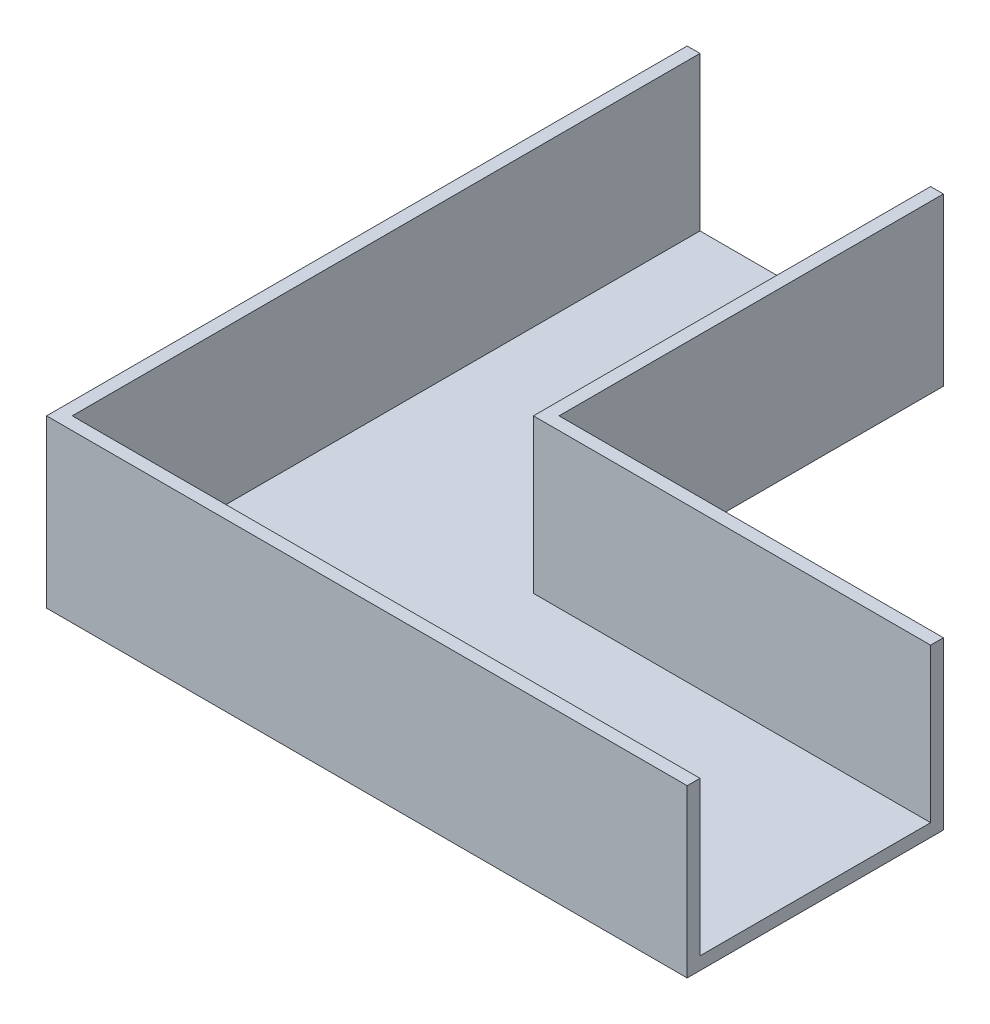
ISO-10303-21;
HEADER;
FILE_DESCRIPTION(('STEP AP214'),'2;1');
FILE_NAME('part.step','',(''),(''),'','','');
FILE_SCHEMA(('AUTOMOTIVE_DESIGN { 1 0 10303 214 1 1 1 1 }'));
ENDSEC;
DATA;
#1=APPLICATION_CONTEXT('core data for automotive mechanical design processes');
#2=APPLICATION_PROTOCOL_DEFINITION('international standard','automotive_design',2000,#1);
#3=PRODUCT_CONTEXT('',#1,'mechanical');
#4=PRODUCT('Part','Part','',(#3));
#5=PRODUCT_RELATED_PRODUCT_CATEGORY('part','',(#4));
#6=PRODUCT_DEFINITION_FORMATION('','',#4);
#7=PRODUCT_DEFINITION_CONTEXT('part definition',#1,'design');
#8=PRODUCT_DEFINITION('design','',#6,#7);
#9=PRODUCT_DEFINITION_SHAPE('','',#8);
#10=(LENGTH_UNIT() NAMED_UNIT(*) SI_UNIT(.MILLI.,.METRE.));
#11=(NAMED_UNIT(*) PLANE_ANGLE_UNIT() SI_UNIT($,.RADIAN.));
#12=(NAMED_UNIT(*) SI_UNIT($,.STERADIAN.) SOLID_ANGLE_UNIT());
#13=UNCERTAINTY_MEASURE_WITH_UNIT(LENGTH_MEASURE(1.E-05),#10,'distance_accuracy_value','');
#14=(GEOMETRIC_REPRESENTATION_CONTEXT(3) GLOBAL_UNCERTAINTY_ASSIGNED_CONTEXT((#13)) GLOBAL_UNIT_ASSIGNED_CONTEXT((#10,
#11,#12)) REPRESENTATION_CONTEXT('',''));
#15=CARTESIAN_POINT('',(0.,0.,0.));
#16=DIRECTION('',(0.,0.,1.));
#17=DIRECTION('',(1.,0.,0.));
#18=AXIS2_PLACEMENT_3D('',#15,#16,#17);
#19=CARTESIAN_POINT('',(0.,330.2,0.));
#20=DIRECTION('',(0.,1.,0.));
#21=DIRECTION('',(0.,0.,1.));
#22=AXIS2_PLACEMENT_3D('',#19,#20,#21);
#23=PLANE('',#22);
#24=DIRECTION('',(0.,0.,-1.));
#25=VECTOR('',#24,1.);
#26=CARTESIAN_POINT('',(482.6,330.2,-482.6));
#27=LINE('',#26,#25);
#28=CARTESIAN_POINT('',(482.6,330.2,-482.6));
#29=VERTEX_POINT('',#28);
#30=CARTESIAN_POINT('',(482.6,330.2,-1270.));
#31=VERTEX_POINT('',#30);
#32=EDGE_CURVE('E169',#29,#31,#27,.T.);
#33=ORIENTED_EDGE('',*,*,#32,.F.);
#34=DIRECTION('',(-1.,0.,0.));
#35=VECTOR('',#34,1.);
#36=CARTESIAN_POINT('',(1270.,330.2,-482.6));
#37=LINE('',#36,#35);
#38=CARTESIAN_POINT('',(1270.,330.2,-482.6));
#39=VERTEX_POINT('',#38);
#40=EDGE_CURVE('E233',#39,#29,#37,.T.);
#41=ORIENTED_EDGE('',*,*,#40,.F.);
#42=DIRECTION('',(0.,0.,-1.));
#43=VECTOR('',#42,1.);
#44=CARTESIAN_POINT('',(1270.,330.2,0.));
#45=LINE('',#44,#43);
#46=CARTESIAN_POINT('',(1270.,330.2,-508.));
#47=VERTEX_POINT('',#46);
#48=EDGE_CURVE('E114',#39,#47,#45,.T.);
#49=ORIENTED_EDGE('',*,*,#48,.T.);
#50=DIRECTION('',(-1.,0.,0.));
#51=VECTOR('',#50,1.);
#52=CARTESIAN_POINT('',(1270.,330.2,-508.));
#53=LINE('',#52,#51);
#54=CARTESIAN_POINT('',(508.,330.2,-508.));
#55=VERTEX_POINT('',#54);
#56=EDGE_CURVE('E105',#47,#55,#53,.T.);
#57=ORIENTED_EDGE('',*,*,#56,.T.);
#58=DIRECTION('',(0.,0.,-1.));
#59=VECTOR('',#58,1.);
#60=CARTESIAN_POINT('',(508.,330.2,-508.));
#61=LINE('',#60,#59);
#62=CARTESIAN_POINT('',(508.,330.2,-1270.));
#63=VERTEX_POINT('',#62);
#64=EDGE_CURVE('E110',#55,#63,#61,.T.);
#65=ORIENTED_EDGE('',*,*,#64,.T.);
#66=DIRECTION('',(-1.,0.,0.));
#67=VECTOR('',#66,1.);
#68=CARTESIAN_POINT('',(508.,330.2,-1270.));
#69=LINE('',#68,#67);
#70=EDGE_CURVE('E133',#63,#31,#69,.T.);
#71=ORIENTED_EDGE('',*,*,#70,.T.);
#72=EDGE_LOOP('',(#33,#41,#49,#57,#65,#71));
#73=FACE_BOUND('',#72,.T.);
#74=ADVANCED_FACE('F35',(#73),#23,.T.);
#75=CARTESIAN_POINT('',(0.,330.2,-1270.));
#76=DIRECTION('',(1.,0.,0.));
#77=DIRECTION('',(0.,0.,-1.));
#78=AXIS2_PLACEMENT_3D('',#75,#76,#77);
#79=PLANE('',#78);
#80=DIRECTION('',(0.,0.,1.));
#81=VECTOR('',#80,1.);
#82=CARTESIAN_POINT('',(0.,0.,-1270.));
#83=LINE('',#82,#81);
#84=CARTESIAN_POINT('',(0.,0.,-1270.));
#85=VERTEX_POINT('',#84);
#86=CARTESIAN_POINT('',(0.,0.,0.));
#87=VERTEX_POINT('',#86);
#88=EDGE_CURVE('E138',#85,#87,#83,.T.);
#89=ORIENTED_EDGE('',*,*,#88,.T.);
#90=DIRECTION('',(0.,-1.,0.));
#91=VECTOR('',#90,1.);
#92=CARTESIAN_POINT('',(0.,330.2,0.));
#93=LINE('',#92,#91);
#94=CARTESIAN_POINT('',(0.,330.2,0.));
#95=VERTEX_POINT('',#94);
#96=EDGE_CURVE('E11',#95,#87,#93,.T.);
#97=ORIENTED_EDGE('',*,*,#96,.F.);
#98=DIRECTION('',(0.,0.,1.));
#99=VECTOR('',#98,1.);
#100=CARTESIAN_POINT('',(0.,330.2,-1270.));
#101=LINE('',#100,#99);
#102=CARTESIAN_POINT('',(0.,330.2,-1270.));
#103=VERTEX_POINT('',#102);
#104=EDGE_CURVE('E150',#103,#95,#101,.T.);
#105=ORIENTED_EDGE('',*,*,#104,.F.);
#106=DIRECTION('',(0.,-1.,0.));
#107=VECTOR('',#106,1.);
#108=CARTESIAN_POINT('',(0.,330.2,-1270.));
#109=LINE('',#108,#107);
#110=EDGE_CURVE('E137',#103,#85,#109,.T.);
#111=ORIENTED_EDGE('',*,*,#110,.T.);
#112=EDGE_LOOP('',(#89,#97,#105,#111));
#113=FACE_BOUND('',#112,.T.);
#114=ADVANCED_FACE('F37',(#113),#79,.F.);
#115=CARTESIAN_POINT('',(0.,330.2,0.));
#116=DIRECTION('',(0.,0.,-1.));
#117=DIRECTION('',(-1.,0.,0.));
#118=AXIS2_PLACEMENT_3D('',#115,#116,#117);
#119=PLANE('',#118);
#120=DIRECTION('',(1.,0.,0.));
#121=VECTOR('',#120,1.);
#122=CARTESIAN_POINT('',(0.,0.,0.));
#123=LINE('',#122,#121);
#124=CARTESIAN_POINT('',(1270.,0.,0.));
#125=VERTEX_POINT('',#124);
#126=EDGE_CURVE('E141',#87,#125,#123,.T.);
#127=ORIENTED_EDGE('',*,*,#126,.T.);
#128=DIRECTION('',(0.,-1.,0.));
#129=VECTOR('',#128,1.);
#130=CARTESIAN_POINT('',(1270.,330.2,0.));
#131=LINE('',#130,#129);
#132=CARTESIAN_POINT('',(1270.,330.2,0.));
#133=VERTEX_POINT('',#132);
#134=EDGE_CURVE('E43',#133,#125,#131,.T.);
#135=ORIENTED_EDGE('',*,*,#134,.F.);
#136=DIRECTION('',(1.,0.,0.));
#137=VECTOR('',#136,1.);
#138=CARTESIAN_POINT('',(0.,330.2,0.));
#139=LINE('',#138,#137);
#140=EDGE_CURVE('E94',#95,#133,#139,.T.);
#141=ORIENTED_EDGE('',*,*,#140,.F.);
#142=ORIENTED_EDGE('',*,*,#96,.T.);
#143=EDGE_LOOP('',(#127,#135,#141,#142));
#144=FACE_BOUND('',#143,.T.);
#145=ADVANCED_FACE('F247',(#144),#119,.F.);
#146=CARTESIAN_POINT('',(1270.,330.2,0.));
#147=DIRECTION('',(-1.,0.,0.));
#148=DIRECTION('',(0.,0.,1.));
#149=AXIS2_PLACEMENT_3D('',#146,#147,#148);
#150=PLANE('',#149);
#151=ORIENTED_EDGE('',*,*,#48,.F.);
#152=DIRECTION('',(0.,1.,0.));
#153=VECTOR('',#152,1.);
#154=CARTESIAN_POINT('',(1270.,25.4,-482.6));
#155=LINE('',#154,#153);
#156=CARTESIAN_POINT('',(1270.,25.4,-482.6));
#157=VERTEX_POINT('',#156);
#158=EDGE_CURVE('E238',#157,#39,#155,.T.);
#159=ORIENTED_EDGE('',*,*,#158,.F.);
#160=DIRECTION('',(0.,0.,-1.));
#161=VECTOR('',#160,1.);
#162=CARTESIAN_POINT('',(1270.,25.4,-25.4));
#163=LINE('',#162,#161);
#164=CARTESIAN_POINT('',(1270.,25.4,-25.4));
#165=VERTEX_POINT('',#164);
#166=EDGE_CURVE('E216',#165,#157,#163,.T.);
#167=ORIENTED_EDGE('',*,*,#166,.F.);
#168=DIRECTION('',(0.,1.,0.));
#169=VECTOR('',#168,1.);
#170=CARTESIAN_POINT('',(1270.,25.4,-25.4));
#171=LINE('',#170,#169);
#172=CARTESIAN_POINT('',(1270.,330.2,-25.4));
#173=VERTEX_POINT('',#172);
#174=EDGE_CURVE('E208',#165,#173,#171,.T.);
#175=ORIENTED_EDGE('',*,*,#174,.T.);
#176=EDGE_CURVE('E118',#133,#173,#45,.T.);
#177=ORIENTED_EDGE('',*,*,#176,.F.);
#178=ORIENTED_EDGE('',*,*,#134,.T.);
#179=DIRECTION('',(0.,0.,-1.));
#180=VECTOR('',#179,1.);
#181=CARTESIAN_POINT('',(1270.,0.,0.));
#182=LINE('',#181,#180);
#183=CARTESIAN_POINT('',(1270.,0.,-508.));
#184=VERTEX_POINT('',#183);
#185=EDGE_CURVE('E144',#125,#184,#182,.T.);
#186=ORIENTED_EDGE('',*,*,#185,.T.);
#187=DIRECTION('',(0.,-1.,0.));
#188=VECTOR('',#187,1.);
#189=CARTESIAN_POINT('',(1270.,330.2,-508.));
#190=LINE('',#189,#188);
#191=EDGE_CURVE('E127',#47,#184,#190,.T.);
#192=ORIENTED_EDGE('',*,*,#191,.F.);
#193=EDGE_LOOP('',(#151,#159,#167,#175,#177,#178,#186,#192));
#194=FACE_BOUND('',#193,.T.);
#195=ADVANCED_FACE('F157',(#194),#150,.F.);
#196=CARTESIAN_POINT('',(1270.,330.2,-508.));
#197=DIRECTION('',(0.,0.,1.));
#198=DIRECTION('',(1.,0.,0.));
#199=AXIS2_PLACEMENT_3D('',#196,#197,#198);
#200=PLANE('',#199);
#201=DIRECTION('',(-1.,0.,0.));
#202=VECTOR('',#201,1.);
#203=CARTESIAN_POINT('',(1270.,0.,-508.));
#204=LINE('',#203,#202);
#205=CARTESIAN_POINT('',(508.,0.,-508.));
#206=VERTEX_POINT('',#205);
#207=EDGE_CURVE('E124',#184,#206,#204,.T.);
#208=ORIENTED_EDGE('',*,*,#207,.T.);
#209=DIRECTION('',(0.,-1.,0.));
#210=VECTOR('',#209,1.);
#211=CARTESIAN_POINT('',(508.,330.2,-508.));
#212=LINE('',#211,#210);
#213=EDGE_CURVE('E121',#55,#206,#212,.T.);
#214=ORIENTED_EDGE('',*,*,#213,.F.);
#215=ORIENTED_EDGE('',*,*,#56,.F.);
#216=ORIENTED_EDGE('',*,*,#191,.T.);
#217=EDGE_LOOP('',(#208,#214,#215,#216));
#218=FACE_BOUND('',#217,.T.);
#219=ADVANCED_FACE('F122',(#218),#200,.F.);
#220=CARTESIAN_POINT('',(508.,330.2,-508.));
#221=DIRECTION('',(-1.,0.,0.));
#222=DIRECTION('',(0.,0.,1.));
#223=AXIS2_PLACEMENT_3D('',#220,#221,#222);
#224=PLANE('',#223);
#225=DIRECTION('',(0.,0.,-1.));
#226=VECTOR('',#225,1.);
#227=CARTESIAN_POINT('',(508.,0.,-508.));
#228=LINE('',#227,#226);
#229=CARTESIAN_POINT('',(508.,0.,-1270.));
#230=VERTEX_POINT('',#229);
#231=EDGE_CURVE('E147',#206,#230,#228,.T.);
#232=ORIENTED_EDGE('',*,*,#231,.T.);
#233=DIRECTION('',(0.,-1.,0.));
#234=VECTOR('',#233,1.);
#235=CARTESIAN_POINT('',(508.,330.2,-1270.));
#236=LINE('',#235,#234);
#237=EDGE_CURVE('E128',#63,#230,#236,.T.);
#238=ORIENTED_EDGE('',*,*,#237,.F.);
#239=ORIENTED_EDGE('',*,*,#64,.F.);
#240=ORIENTED_EDGE('',*,*,#213,.T.);
#241=EDGE_LOOP('',(#232,#238,#239,#240));
#242=FACE_BOUND('',#241,.T.);
#243=ADVANCED_FACE('F130',(#242),#224,.F.);
#244=CARTESIAN_POINT('',(508.,330.2,-1270.));
#245=DIRECTION('',(0.,0.,1.));
#246=DIRECTION('',(1.,0.,0.));
#247=AXIS2_PLACEMENT_3D('',#244,#245,#246);
#248=PLANE('',#247);
#249=DIRECTION('',(-1.,0.,0.));
#250=VECTOR('',#249,1.);
#251=CARTESIAN_POINT('',(482.6,25.4,-1270.));
#252=LINE('',#251,#250);
#253=CARTESIAN_POINT('',(482.6,25.4,-1270.));
#254=VERTEX_POINT('',#253);
#255=CARTESIAN_POINT('',(25.4,25.4,-1270.));
#256=VERTEX_POINT('',#255);
#257=EDGE_CURVE('E220',#254,#256,#252,.T.);
#258=ORIENTED_EDGE('',*,*,#257,.F.);
#259=DIRECTION('',(0.,1.,0.));
#260=VECTOR('',#259,1.);
#261=CARTESIAN_POINT('',(482.6,25.4,-1270.));
#262=LINE('',#261,#260);
#263=EDGE_CURVE('E142',#254,#31,#262,.T.);
#264=ORIENTED_EDGE('',*,*,#263,.T.);
#265=ORIENTED_EDGE('',*,*,#70,.F.);
#266=ORIENTED_EDGE('',*,*,#237,.T.);
#267=DIRECTION('',(-1.,0.,0.));
#268=VECTOR('',#267,1.);
#269=CARTESIAN_POINT('',(508.,0.,-1270.));
#270=LINE('',#269,#268);
#271=EDGE_CURVE('E86',#230,#85,#270,.T.);
#272=ORIENTED_EDGE('',*,*,#271,.T.);
#273=ORIENTED_EDGE('',*,*,#110,.F.);
#274=CARTESIAN_POINT('',(25.4000000000001,330.2,-1270.));
#275=VERTEX_POINT('',#274);
#276=EDGE_CURVE('E58',#275,#103,#69,.T.);
#277=ORIENTED_EDGE('',*,*,#276,.F.);
#278=DIRECTION('',(0.,1.,0.));
#279=VECTOR('',#278,1.);
#280=CARTESIAN_POINT('',(25.4,25.4,-1270.));
#281=LINE('',#280,#279);
#282=EDGE_CURVE('E50',#256,#275,#281,.T.);
#283=ORIENTED_EDGE('',*,*,#282,.F.);
#284=EDGE_LOOP('',(#258,#264,#265,#266,#272,#273,#277,#283));
#285=FACE_BOUND('',#284,.T.);
#286=ADVANCED_FACE('F164',(#285),#248,.F.);
#287=DIRECTION('',(1.,0.,0.));
#288=VECTOR('',#287,1.);
#289=CARTESIAN_POINT('',(25.4000000000002,330.2,-25.4));
#290=LINE('',#289,#288);
#291=CARTESIAN_POINT('',(25.4000000000002,330.2,-25.4));
#292=VERTEX_POINT('',#291);
#293=EDGE_CURVE('E231',#292,#173,#290,.T.);
#294=ORIENTED_EDGE('',*,*,#293,.F.);
#295=DIRECTION('',(0.,0.,1.));
#296=VECTOR('',#295,1.);
#297=CARTESIAN_POINT('',(25.4,330.2,-1270.));
#298=LINE('',#297,#296);
#299=EDGE_CURVE('E205',#275,#292,#298,.T.);
#300=ORIENTED_EDGE('',*,*,#299,.F.);
#301=ORIENTED_EDGE('',*,*,#276,.T.);
#302=ORIENTED_EDGE('',*,*,#104,.T.);
#303=ORIENTED_EDGE('',*,*,#140,.T.);
#304=ORIENTED_EDGE('',*,*,#176,.T.);
#305=EDGE_LOOP('',(#294,#300,#301,#302,#303,#304));
#306=FACE_BOUND('',#305,.T.);
#307=ADVANCED_FACE('F243',(#306),#23,.T.);
#308=CARTESIAN_POINT('',(0.,0.,0.));
#309=DIRECTION('',(0.,1.,0.));
#310=DIRECTION('',(0.,0.,1.));
#311=AXIS2_PLACEMENT_3D('',#308,#309,#310);
#312=PLANE('',#311);
#313=ORIENTED_EDGE('',*,*,#88,.F.);
#314=ORIENTED_EDGE('',*,*,#271,.F.);
#315=ORIENTED_EDGE('',*,*,#231,.F.);
#316=ORIENTED_EDGE('',*,*,#207,.F.);
#317=ORIENTED_EDGE('',*,*,#185,.F.);
#318=ORIENTED_EDGE('',*,*,#126,.F.);
#319=EDGE_LOOP('',(#313,#314,#315,#316,#317,#318));
#320=FACE_BOUND('',#319,.T.);
#321=ADVANCED_FACE('F162',(#320),#312,.F.);
#322=CARTESIAN_POINT('',(482.6,25.4,-482.6));
#323=DIRECTION('',(1.,0.,0.));
#324=DIRECTION('',(0.,0.,-1.));
#325=AXIS2_PLACEMENT_3D('',#322,#323,#324);
#326=PLANE('',#325);
#327=ORIENTED_EDGE('',*,*,#32,.T.);
#328=ORIENTED_EDGE('',*,*,#263,.F.);
#329=DIRECTION('',(0.,0.,-1.));
#330=VECTOR('',#329,1.);
#331=CARTESIAN_POINT('',(482.6,25.4,-482.6));
#332=LINE('',#331,#330);
#333=CARTESIAN_POINT('',(482.6,25.4,-482.6));
#334=VERTEX_POINT('',#333);
#335=EDGE_CURVE('E228',#334,#254,#332,.T.);
#336=ORIENTED_EDGE('',*,*,#335,.F.);
#337=DIRECTION('',(0.,1.,0.));
#338=VECTOR('',#337,1.);
#339=CARTESIAN_POINT('',(482.6,25.4,-482.6));
#340=LINE('',#339,#338);
#341=EDGE_CURVE('E178',#334,#29,#340,.T.);
#342=ORIENTED_EDGE('',*,*,#341,.T.);
#343=EDGE_LOOP('',(#327,#328,#336,#342));
#344=FACE_BOUND('',#343,.T.);
#345=ADVANCED_FACE('F265',(#344),#326,.F.);
#346=CARTESIAN_POINT('',(1270.,25.4,-482.6));
#347=DIRECTION('',(0.,0.,-1.));
#348=DIRECTION('',(-1.,0.,0.));
#349=AXIS2_PLACEMENT_3D('',#346,#347,#348);
#350=PLANE('',#349);
#351=ORIENTED_EDGE('',*,*,#40,.T.);
#352=ORIENTED_EDGE('',*,*,#341,.F.);
#353=DIRECTION('',(-1.,0.,0.));
#354=VECTOR('',#353,1.);
#355=CARTESIAN_POINT('',(1270.,25.4,-482.6));
#356=LINE('',#355,#354);
#357=EDGE_CURVE('E225',#157,#334,#356,.T.);
#358=ORIENTED_EDGE('',*,*,#357,.F.);
#359=ORIENTED_EDGE('',*,*,#158,.T.);
#360=EDGE_LOOP('',(#351,#352,#358,#359));
#361=FACE_BOUND('',#360,.T.);
#362=ADVANCED_FACE('F313',(#361),#350,.F.);
#363=CARTESIAN_POINT('',(25.4000000000002,25.4,-25.4));
#364=DIRECTION('',(0.,0.,1.));
#365=DIRECTION('',(1.,0.,0.));
#366=AXIS2_PLACEMENT_3D('',#363,#364,#365);
#367=PLANE('',#366);
#368=ORIENTED_EDGE('',*,*,#293,.T.);
#369=ORIENTED_EDGE('',*,*,#174,.F.);
#370=DIRECTION('',(1.,0.,0.));
#371=VECTOR('',#370,1.);
#372=CARTESIAN_POINT('',(25.4000000000002,25.4,-25.4));
#373=LINE('',#372,#371);
#374=CARTESIAN_POINT('',(25.4000000000002,25.4,-25.4));
#375=VERTEX_POINT('',#374);
#376=EDGE_CURVE('E211',#375,#165,#373,.T.);
#377=ORIENTED_EDGE('',*,*,#376,.F.);
#378=DIRECTION('',(0.,1.,0.));
#379=VECTOR('',#378,1.);
#380=CARTESIAN_POINT('',(25.4000000000002,25.4,-25.4));
#381=LINE('',#380,#379);
#382=EDGE_CURVE('E199',#375,#292,#381,.T.);
#383=ORIENTED_EDGE('',*,*,#382,.T.);
#384=EDGE_LOOP('',(#368,#369,#377,#383));
#385=FACE_BOUND('',#384,.T.);
#386=ADVANCED_FACE('F212',(#385),#367,.F.);
#387=CARTESIAN_POINT('',(25.4,25.4,-1270.));
#388=DIRECTION('',(-1.,0.,0.));
#389=DIRECTION('',(0.,0.,1.));
#390=AXIS2_PLACEMENT_3D('',#387,#388,#389);
#391=PLANE('',#390);
#392=ORIENTED_EDGE('',*,*,#299,.T.);
#393=ORIENTED_EDGE('',*,*,#382,.F.);
#394=DIRECTION('',(0.,0.,1.));
#395=VECTOR('',#394,1.);
#396=CARTESIAN_POINT('',(25.4,25.4,-1270.));
#397=LINE('',#396,#395);
#398=EDGE_CURVE('E203',#256,#375,#397,.T.);
#399=ORIENTED_EDGE('',*,*,#398,.F.);
#400=ORIENTED_EDGE('',*,*,#282,.T.);
#401=EDGE_LOOP('',(#392,#393,#399,#400));
#402=FACE_BOUND('',#401,.T.);
#403=ADVANCED_FACE('F201',(#402),#391,.F.);
#404=CARTESIAN_POINT('',(0.,25.4,0.));
#405=DIRECTION('',(0.,1.,0.));
#406=DIRECTION('',(0.,0.,1.));
#407=AXIS2_PLACEMENT_3D('',#404,#405,#406);
#408=PLANE('',#407);
#409=ORIENTED_EDGE('',*,*,#257,.T.);
#410=ORIENTED_EDGE('',*,*,#398,.T.);
#411=ORIENTED_EDGE('',*,*,#376,.T.);
#412=ORIENTED_EDGE('',*,*,#166,.T.);
#413=ORIENTED_EDGE('',*,*,#357,.T.);
#414=ORIENTED_EDGE('',*,*,#335,.T.);
#415=EDGE_LOOP('',(#409,#410,#411,#412,#413,#414));
#416=FACE_BOUND('',#415,.T.);
#417=ADVANCED_FACE('F218',(#416),#408,.T.);
#418=CLOSED_SHELL('',(#74,#114,#145,#195,#219,#243,#286,#307,#321,#345,#362,#386,#403,#417));
#419=MANIFOLD_SOLID_BREP('B2',#418);
#420=ADVANCED_BREP_SHAPE_REPRESENTATION('',(#18,#419),#14);
#421=SHAPE_DEFINITION_REPRESENTATION(#9,#420);
ENDSEC;
END-ISO-10303-21;
